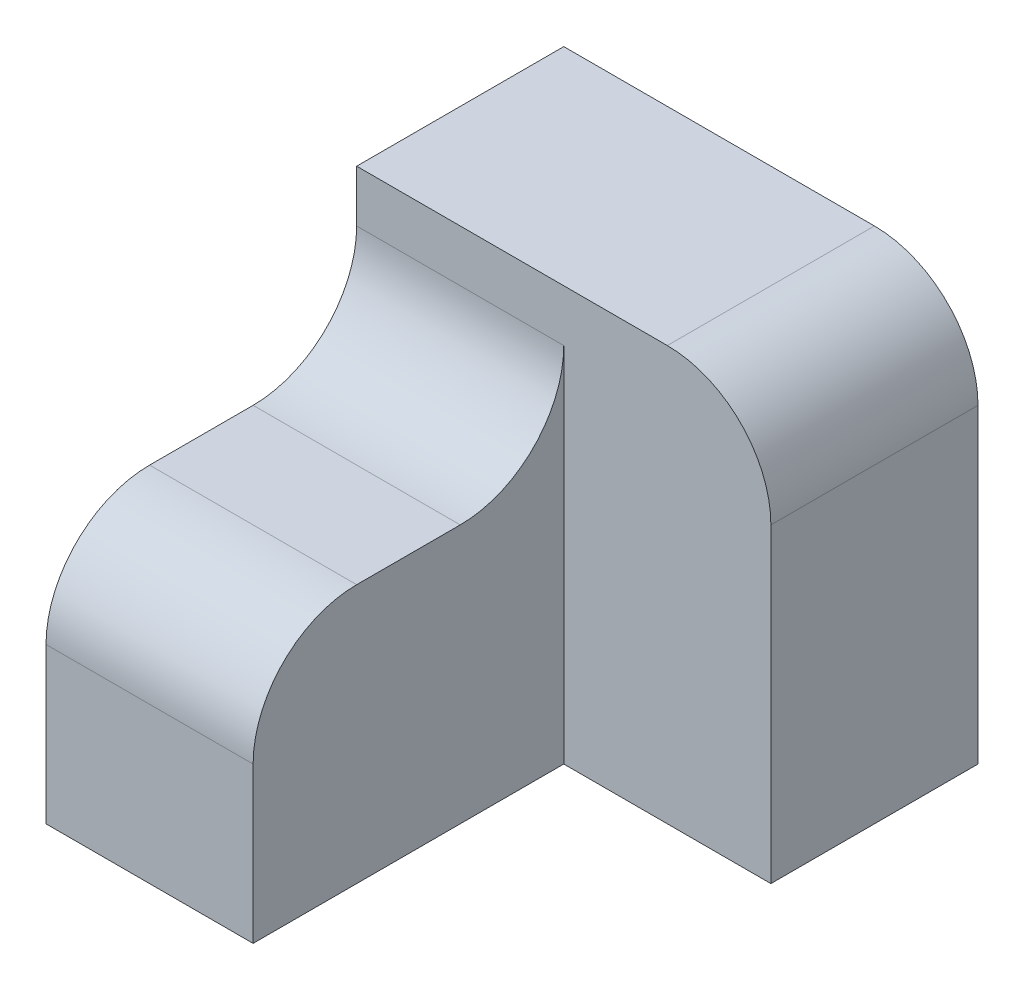
ISO-10303-21;
HEADER;
FILE_DESCRIPTION(('STEP AP214'),'2;1');
FILE_NAME('part.step','',(''),(''),'','','');
FILE_SCHEMA(('AUTOMOTIVE_DESIGN { 1 0 10303 214 1 1 1 1 }'));
ENDSEC;
DATA;
#1=APPLICATION_CONTEXT('core data for automotive mechanical design processes');
#2=APPLICATION_PROTOCOL_DEFINITION('international standard','automotive_design',2000,#1);
#3=PRODUCT_CONTEXT('',#1,'mechanical');
#4=PRODUCT('Part','Part','',(#3));
#5=PRODUCT_RELATED_PRODUCT_CATEGORY('part','',(#4));
#6=PRODUCT_DEFINITION_FORMATION('','',#4);
#7=PRODUCT_DEFINITION_CONTEXT('part definition',#1,'design');
#8=PRODUCT_DEFINITION('design','',#6,#7);
#9=PRODUCT_DEFINITION_SHAPE('','',#8);
#10=(LENGTH_UNIT() NAMED_UNIT(*) SI_UNIT(.MILLI.,.METRE.));
#11=(NAMED_UNIT(*) PLANE_ANGLE_UNIT() SI_UNIT($,.RADIAN.));
#12=(NAMED_UNIT(*) SI_UNIT($,.STERADIAN.) SOLID_ANGLE_UNIT());
#13=UNCERTAINTY_MEASURE_WITH_UNIT(LENGTH_MEASURE(1.E-05),#10,'distance_accuracy_value','');
#14=(GEOMETRIC_REPRESENTATION_CONTEXT(3) GLOBAL_UNCERTAINTY_ASSIGNED_CONTEXT((#13)) GLOBAL_UNIT_ASSIGNED_CONTEXT((#10,
#11,#12)) REPRESENTATION_CONTEXT('',''));
#15=CARTESIAN_POINT('',(0.,0.,0.));
#16=DIRECTION('',(0.,0.,1.));
#17=DIRECTION('',(1.,0.,0.));
#18=AXIS2_PLACEMENT_3D('',#15,#16,#17);
#19=CARTESIAN_POINT('',(-10.,0.,30.));
#20=DIRECTION('',(0.,-1.,0.));
#21=DIRECTION('',(1.,0.,0.));
#22=AXIS2_PLACEMENT_3D('',#19,#20,#21);
#23=PLANE('',#22);
#24=DIRECTION('',(0.,0.,-1.));
#25=VECTOR('',#24,1.);
#26=CARTESIAN_POINT('',(-10.,0.,30.));
#27=LINE('',#26,#25);
#28=CARTESIAN_POINT('',(-10.,0.,20.));
#29=VERTEX_POINT('',#28);
#30=CARTESIAN_POINT('',(-10.,0.,10.));
#31=VERTEX_POINT('',#30);
#32=EDGE_CURVE('E164',#29,#31,#27,.T.);
#33=ORIENTED_EDGE('',*,*,#32,.T.);
#34=DIRECTION('',(-1.,0.,0.));
#35=VECTOR('',#34,1.);
#36=CARTESIAN_POINT('',(-10.,0.,10.));
#37=LINE('',#36,#35);
#38=CARTESIAN_POINT('',(-30.,0.,10.));
#39=VERTEX_POINT('',#38);
#40=EDGE_CURVE('E178',#31,#39,#37,.T.);
#41=ORIENTED_EDGE('',*,*,#40,.T.);
#42=DIRECTION('',(0.,0.,-1.));
#43=VECTOR('',#42,1.);
#44=CARTESIAN_POINT('',(-30.,0.,30.));
#45=LINE('',#44,#43);
#46=CARTESIAN_POINT('',(-30.,0.,20.));
#47=VERTEX_POINT('',#46);
#48=EDGE_CURVE('E173',#47,#39,#45,.T.);
#49=ORIENTED_EDGE('',*,*,#48,.F.);
#50=DIRECTION('',(-1.,0.,0.));
#51=VECTOR('',#50,1.);
#52=CARTESIAN_POINT('',(-10.,0.,20.));
#53=LINE('',#52,#51);
#54=EDGE_CURVE('E176',#47,#29,#53,.F.);
#55=ORIENTED_EDGE('',*,*,#54,.T.);
#56=EDGE_LOOP('',(#33,#41,#49,#55));
#57=FACE_BOUND('',#56,.T.);
#58=ADVANCED_FACE('F35',(#57),#23,.F.);
#59=CARTESIAN_POINT('',(-30.,0.,30.));
#60=DIRECTION('',(1.,0.,0.));
#61=DIRECTION('',(0.,0.,-1.));
#62=AXIS2_PLACEMENT_3D('',#59,#60,#61);
#63=PLANE('',#62);
#64=DIRECTION('',(0.,-1.,0.));
#65=VECTOR('',#64,1.);
#66=CARTESIAN_POINT('',(-30.,0.,30.));
#67=LINE('',#66,#65);
#68=CARTESIAN_POINT('',(-30.,-10.,30.));
#69=VERTEX_POINT('',#68);
#70=CARTESIAN_POINT('',(-30.,-25.,30.));
#71=VERTEX_POINT('',#70);
#72=EDGE_CURVE('E158',#69,#71,#67,.T.);
#73=ORIENTED_EDGE('',*,*,#72,.F.);
#74=CARTESIAN_POINT('',(-30.,-10.,20.));
#75=DIRECTION('',(1.,0.,0.));
#76=DIRECTION('',(0.,0.,-1.));
#77=AXIS2_PLACEMENT_3D('',#74,#75,#76);
#78=CIRCLE('',#77,10.);
#79=EDGE_CURVE('E58',#69,#47,#78,.F.);
#80=ORIENTED_EDGE('',*,*,#79,.T.);
#81=ORIENTED_EDGE('',*,*,#48,.T.);
#82=CARTESIAN_POINT('',(-30.,10.,10.));
#83=DIRECTION('',(1.,0.,0.));
#84=DIRECTION('',(0.,0.,-1.));
#85=AXIS2_PLACEMENT_3D('',#82,#83,#84);
#86=CIRCLE('',#85,10.);
#87=CARTESIAN_POINT('',(-30.,10.,0.));
#88=VERTEX_POINT('',#87);
#89=EDGE_CURVE('E43',#39,#88,#86,.T.);
#90=ORIENTED_EDGE('',*,*,#89,.T.);
#91=DIRECTION('',(0.,-1.,0.));
#92=VECTOR('',#91,1.);
#93=CARTESIAN_POINT('',(-30.,15.,0.));
#94=LINE('',#93,#92);
#95=CARTESIAN_POINT('',(-30.,15.,0.));
#96=VERTEX_POINT('',#95);
#97=EDGE_CURVE('E134',#96,#88,#94,.T.);
#98=ORIENTED_EDGE('',*,*,#97,.F.);
#99=DIRECTION('',(0.,0.,1.));
#100=VECTOR('',#99,1.);
#101=CARTESIAN_POINT('',(-30.,15.,-20.));
#102=LINE('',#101,#100);
#103=CARTESIAN_POINT('',(-30.,15.,-20.));
#104=VERTEX_POINT('',#103);
#105=EDGE_CURVE('E118',#104,#96,#102,.T.);
#106=ORIENTED_EDGE('',*,*,#105,.F.);
#107=DIRECTION('',(0.,-1.,0.));
#108=VECTOR('',#107,1.);
#109=CARTESIAN_POINT('',(-30.,15.,-20.));
#110=LINE('',#109,#108);
#111=CARTESIAN_POINT('',(-30.,-25.,-20.));
#112=VERTEX_POINT('',#111);
#113=EDGE_CURVE('E125',#104,#112,#110,.T.);
#114=ORIENTED_EDGE('',*,*,#113,.T.);
#115=DIRECTION('',(0.,0.,-1.));
#116=VECTOR('',#115,1.);
#117=CARTESIAN_POINT('',(-30.,-25.,30.));
#118=LINE('',#117,#116);
#119=EDGE_CURVE('E171',#71,#112,#118,.T.);
#120=ORIENTED_EDGE('',*,*,#119,.F.);
#121=EDGE_LOOP('',(#73,#80,#81,#90,#98,#106,#114,#120));
#122=FACE_BOUND('',#121,.T.);
#123=ADVANCED_FACE('F131',(#122),#63,.F.);
#124=CARTESIAN_POINT('',(-30.,-25.,30.));
#125=DIRECTION('',(0.,1.,0.));
#126=DIRECTION('',(0.,0.,1.));
#127=AXIS2_PLACEMENT_3D('',#124,#125,#126);
#128=PLANE('',#127);
#129=ORIENTED_EDGE('',*,*,#119,.T.);
#130=DIRECTION('',(1.,0.,0.));
#131=VECTOR('',#130,1.);
#132=CARTESIAN_POINT('',(-30.,-25.,-20.));
#133=LINE('',#132,#131);
#134=CARTESIAN_POINT('',(10.,-25.,-20.));
#135=VERTEX_POINT('',#134);
#136=EDGE_CURVE('E142',#112,#135,#133,.T.);
#137=ORIENTED_EDGE('',*,*,#136,.T.);
#138=DIRECTION('',(0.,0.,1.));
#139=VECTOR('',#138,1.);
#140=CARTESIAN_POINT('',(10.,-25.,-20.));
#141=LINE('',#140,#139);
#142=CARTESIAN_POINT('',(10.,-25.,0.));
#143=VERTEX_POINT('',#142);
#144=EDGE_CURVE('E135',#135,#143,#141,.T.);
#145=ORIENTED_EDGE('',*,*,#144,.T.);
#146=DIRECTION('',(1.,0.,0.));
#147=VECTOR('',#146,1.);
#148=CARTESIAN_POINT('',(-30.,-25.,0.));
#149=LINE('',#148,#147);
#150=CARTESIAN_POINT('',(-10.,-25.,0.));
#151=VERTEX_POINT('',#150);
#152=EDGE_CURVE('E151',#151,#143,#149,.T.);
#153=ORIENTED_EDGE('',*,*,#152,.F.);
#154=DIRECTION('',(0.,0.,-1.));
#155=VECTOR('',#154,1.);
#156=CARTESIAN_POINT('',(-10.,-25.,30.));
#157=LINE('',#156,#155);
#158=CARTESIAN_POINT('',(-10.,-25.,30.));
#159=VERTEX_POINT('',#158);
#160=EDGE_CURVE('E168',#159,#151,#157,.T.);
#161=ORIENTED_EDGE('',*,*,#160,.F.);
#162=DIRECTION('',(1.,0.,0.));
#163=VECTOR('',#162,1.);
#164=CARTESIAN_POINT('',(-30.,-25.,30.));
#165=LINE('',#164,#163);
#166=EDGE_CURVE('E160',#71,#159,#165,.T.);
#167=ORIENTED_EDGE('',*,*,#166,.F.);
#168=EDGE_LOOP('',(#129,#137,#145,#153,#161,#167));
#169=FACE_BOUND('',#168,.T.);
#170=ADVANCED_FACE('F210',(#169),#128,.F.);
#171=CARTESIAN_POINT('',(-10.,-25.,30.));
#172=DIRECTION('',(-1.,0.,0.));
#173=DIRECTION('',(0.,0.,1.));
#174=AXIS2_PLACEMENT_3D('',#171,#172,#173);
#175=PLANE('',#174);
#176=ORIENTED_EDGE('',*,*,#32,.F.);
#177=CARTESIAN_POINT('',(-10.,-10.,20.));
#178=DIRECTION('',(-1.,0.,0.));
#179=DIRECTION('',(0.,0.,1.));
#180=AXIS2_PLACEMENT_3D('',#177,#178,#179);
#181=CIRCLE('',#180,10.);
#182=CARTESIAN_POINT('',(-10.,-10.,30.));
#183=VERTEX_POINT('',#182);
#184=EDGE_CURVE('E50',#29,#183,#181,.F.);
#185=ORIENTED_EDGE('',*,*,#184,.T.);
#186=DIRECTION('',(0.,1.,0.));
#187=VECTOR('',#186,1.);
#188=CARTESIAN_POINT('',(-10.,-25.,30.));
#189=LINE('',#188,#187);
#190=EDGE_CURVE('E162',#159,#183,#189,.T.);
#191=ORIENTED_EDGE('',*,*,#190,.F.);
#192=ORIENTED_EDGE('',*,*,#160,.T.);
#193=DIRECTION('',(0.,1.,0.));
#194=VECTOR('',#193,1.);
#195=CARTESIAN_POINT('',(-10.,-25.,0.));
#196=LINE('',#195,#194);
#197=CARTESIAN_POINT('',(-10.,10.,0.));
#198=VERTEX_POINT('',#197);
#199=EDGE_CURVE('E156',#151,#198,#196,.T.);
#200=ORIENTED_EDGE('',*,*,#199,.T.);
#201=CARTESIAN_POINT('',(-10.,10.,10.));
#202=DIRECTION('',(-1.,0.,0.));
#203=DIRECTION('',(0.,0.,1.));
#204=AXIS2_PLACEMENT_3D('',#201,#202,#203);
#205=CIRCLE('',#204,10.);
#206=EDGE_CURVE('E11',#198,#31,#205,.T.);
#207=ORIENTED_EDGE('',*,*,#206,.T.);
#208=EDGE_LOOP('',(#176,#185,#191,#192,#200,#207));
#209=FACE_BOUND('',#208,.T.);
#210=ADVANCED_FACE('F203',(#209),#175,.F.);
#211=CARTESIAN_POINT('',(0.,0.,30.));
#212=DIRECTION('',(0.,0.,1.));
#213=DIRECTION('',(1.,0.,0.));
#214=AXIS2_PLACEMENT_3D('',#211,#212,#213);
#215=PLANE('',#214);
#216=ORIENTED_EDGE('',*,*,#190,.T.);
#217=DIRECTION('',(-1.,0.,0.));
#218=VECTOR('',#217,1.);
#219=CARTESIAN_POINT('',(-30.,-10.,30.));
#220=LINE('',#219,#218);
#221=EDGE_CURVE('E192',#183,#69,#220,.T.);
#222=ORIENTED_EDGE('',*,*,#221,.T.);
#223=ORIENTED_EDGE('',*,*,#72,.T.);
#224=ORIENTED_EDGE('',*,*,#166,.T.);
#225=EDGE_LOOP('',(#216,#222,#223,#224));
#226=FACE_BOUND('',#225,.T.);
#227=ADVANCED_FACE('F206',(#226),#215,.T.);
#228=CARTESIAN_POINT('',(0.,0.,0.));
#229=DIRECTION('',(0.,0.,1.));
#230=DIRECTION('',(1.,0.,0.));
#231=AXIS2_PLACEMENT_3D('',#228,#229,#230);
#232=PLANE('',#231);
#233=ORIENTED_EDGE('',*,*,#97,.T.);
#234=DIRECTION('',(-1.,0.,0.));
#235=VECTOR('',#234,1.);
#236=CARTESIAN_POINT('',(0.,10.,0.));
#237=LINE('',#236,#235);
#238=EDGE_CURVE('E183',#88,#198,#237,.F.);
#239=ORIENTED_EDGE('',*,*,#238,.T.);
#240=ORIENTED_EDGE('',*,*,#199,.F.);
#241=ORIENTED_EDGE('',*,*,#152,.T.);
#242=DIRECTION('',(0.,1.,0.));
#243=VECTOR('',#242,1.);
#244=CARTESIAN_POINT('',(10.,-25.,0.));
#245=LINE('',#244,#243);
#246=CARTESIAN_POINT('',(10.,5.,0.));
#247=VERTEX_POINT('',#246);
#248=EDGE_CURVE('E126',#143,#247,#245,.T.);
#249=ORIENTED_EDGE('',*,*,#248,.T.);
#250=CARTESIAN_POINT('',(0.,5.,0.));
#251=DIRECTION('',(0.,0.,1.));
#252=DIRECTION('',(1.,0.,0.));
#253=AXIS2_PLACEMENT_3D('',#250,#251,#252);
#254=CIRCLE('',#253,10.);
#255=CARTESIAN_POINT('',(0.,15.,0.));
#256=VERTEX_POINT('',#255);
#257=EDGE_CURVE('E181',#247,#256,#254,.T.);
#258=ORIENTED_EDGE('',*,*,#257,.T.);
#259=DIRECTION('',(-1.,0.,0.));
#260=VECTOR('',#259,1.);
#261=CARTESIAN_POINT('',(10.,15.,0.));
#262=LINE('',#261,#260);
#263=EDGE_CURVE('E148',#256,#96,#262,.T.);
#264=ORIENTED_EDGE('',*,*,#263,.T.);
#265=EDGE_LOOP('',(#233,#239,#240,#241,#249,#258,#264));
#266=FACE_BOUND('',#265,.T.);
#267=ADVANCED_FACE('F200',(#266),#232,.T.);
#268=CARTESIAN_POINT('',(10.,15.,-20.));
#269=DIRECTION('',(0.,1.,0.));
#270=DIRECTION('',(-1.,0.,0.));
#271=AXIS2_PLACEMENT_3D('',#268,#269,#270);
#272=PLANE('',#271);
#273=ORIENTED_EDGE('',*,*,#263,.F.);
#274=DIRECTION('',(0.,0.,1.));
#275=VECTOR('',#274,1.);
#276=CARTESIAN_POINT('',(0.,15.,-20.));
#277=LINE('',#276,#275);
#278=CARTESIAN_POINT('',(0.,15.,-20.));
#279=VERTEX_POINT('',#278);
#280=EDGE_CURVE('E121',#256,#279,#277,.F.);
#281=ORIENTED_EDGE('',*,*,#280,.T.);
#282=DIRECTION('',(-1.,0.,0.));
#283=VECTOR('',#282,1.);
#284=CARTESIAN_POINT('',(10.,15.,-20.));
#285=LINE('',#284,#283);
#286=EDGE_CURVE('E114',#279,#104,#285,.T.);
#287=ORIENTED_EDGE('',*,*,#286,.T.);
#288=ORIENTED_EDGE('',*,*,#105,.T.);
#289=EDGE_LOOP('',(#273,#281,#287,#288));
#290=FACE_BOUND('',#289,.T.);
#291=ADVANCED_FACE('F117',(#290),#272,.T.);
#292=CARTESIAN_POINT('',(10.,-25.,-20.));
#293=DIRECTION('',(1.,0.,0.));
#294=DIRECTION('',(0.,0.,-1.));
#295=AXIS2_PLACEMENT_3D('',#292,#293,#294);
#296=PLANE('',#295);
#297=DIRECTION('',(0.,1.,0.));
#298=VECTOR('',#297,1.);
#299=CARTESIAN_POINT('',(10.,-25.,-20.));
#300=LINE('',#299,#298);
#301=CARTESIAN_POINT('',(10.,5.,-20.));
#302=VERTEX_POINT('',#301);
#303=EDGE_CURVE('E136',#135,#302,#300,.T.);
#304=ORIENTED_EDGE('',*,*,#303,.T.);
#305=DIRECTION('',(0.,0.,1.));
#306=VECTOR('',#305,1.);
#307=CARTESIAN_POINT('',(10.,5.,-20.));
#308=LINE('',#307,#306);
#309=EDGE_CURVE('E186',#302,#247,#308,.T.);
#310=ORIENTED_EDGE('',*,*,#309,.T.);
#311=ORIENTED_EDGE('',*,*,#248,.F.);
#312=ORIENTED_EDGE('',*,*,#144,.F.);
#313=EDGE_LOOP('',(#304,#310,#311,#312));
#314=FACE_BOUND('',#313,.T.);
#315=ADVANCED_FACE('F214',(#314),#296,.T.);
#316=CARTESIAN_POINT('',(0.,0.,-20.));
#317=DIRECTION('',(0.,0.,1.));
#318=DIRECTION('',(1.,0.,0.));
#319=AXIS2_PLACEMENT_3D('',#316,#317,#318);
#320=PLANE('',#319);
#321=ORIENTED_EDGE('',*,*,#286,.F.);
#322=CARTESIAN_POINT('',(0.,5.,-20.));
#323=DIRECTION('',(0.,0.,1.));
#324=DIRECTION('',(1.,0.,0.));
#325=AXIS2_PLACEMENT_3D('',#322,#323,#324);
#326=CIRCLE('',#325,10.);
#327=EDGE_CURVE('E190',#279,#302,#326,.F.);
#328=ORIENTED_EDGE('',*,*,#327,.T.);
#329=ORIENTED_EDGE('',*,*,#303,.F.);
#330=ORIENTED_EDGE('',*,*,#136,.F.);
#331=ORIENTED_EDGE('',*,*,#113,.F.);
#332=EDGE_LOOP('',(#321,#328,#329,#330,#331));
#333=FACE_BOUND('',#332,.T.);
#334=ADVANCED_FACE('F139',(#333),#320,.F.);
#335=CARTESIAN_POINT('',(-10.,10.,10.));
#336=DIRECTION('',(-1.,0.,0.));
#337=DIRECTION('',(0.,-1.,0.));
#338=AXIS2_PLACEMENT_3D('',#335,#336,#337);
#339=CYLINDRICAL_SURFACE('',#338,10.);
#340=ORIENTED_EDGE('',*,*,#206,.F.);
#341=ORIENTED_EDGE('',*,*,#238,.F.);
#342=ORIENTED_EDGE('',*,*,#89,.F.);
#343=ORIENTED_EDGE('',*,*,#40,.F.);
#344=EDGE_LOOP('',(#340,#341,#342,#343));
#345=FACE_BOUND('',#344,.T.);
#346=ADVANCED_FACE('F202',(#345),#339,.F.);
#347=CARTESIAN_POINT('',(0.,5.,-20.));
#348=DIRECTION('',(0.,0.,1.));
#349=DIRECTION('',(1.,0.,0.));
#350=AXIS2_PLACEMENT_3D('',#347,#348,#349);
#351=CYLINDRICAL_SURFACE('',#350,10.);
#352=ORIENTED_EDGE('',*,*,#327,.F.);
#353=ORIENTED_EDGE('',*,*,#280,.F.);
#354=ORIENTED_EDGE('',*,*,#257,.F.);
#355=ORIENTED_EDGE('',*,*,#309,.F.);
#356=EDGE_LOOP('',(#352,#353,#354,#355));
#357=FACE_BOUND('',#356,.T.);
#358=ADVANCED_FACE('F217',(#357),#351,.T.);
#359=CARTESIAN_POINT('',(0.,-10.,20.));
#360=DIRECTION('',(1.,0.,0.));
#361=DIRECTION('',(0.,1.,0.));
#362=AXIS2_PLACEMENT_3D('',#359,#360,#361);
#363=CYLINDRICAL_SURFACE('',#362,10.);
#364=ORIENTED_EDGE('',*,*,#184,.F.);
#365=ORIENTED_EDGE('',*,*,#54,.F.);
#366=ORIENTED_EDGE('',*,*,#79,.F.);
#367=ORIENTED_EDGE('',*,*,#221,.F.);
#368=EDGE_LOOP('',(#364,#365,#366,#367));
#369=FACE_BOUND('',#368,.T.);
#370=ADVANCED_FACE('F37',(#369),#363,.T.);
#371=CLOSED_SHELL('',(#58,#123,#170,#210,#227,#267,#291,#315,#334,#346,#358,#370));
#372=MANIFOLD_SOLID_BREP('B2',#371);
#373=ADVANCED_BREP_SHAPE_REPRESENTATION('',(#18,#372),#14);
#374=SHAPE_DEFINITION_REPRESENTATION(#9,#373);
ENDSEC;
END-ISO-10303-21;
